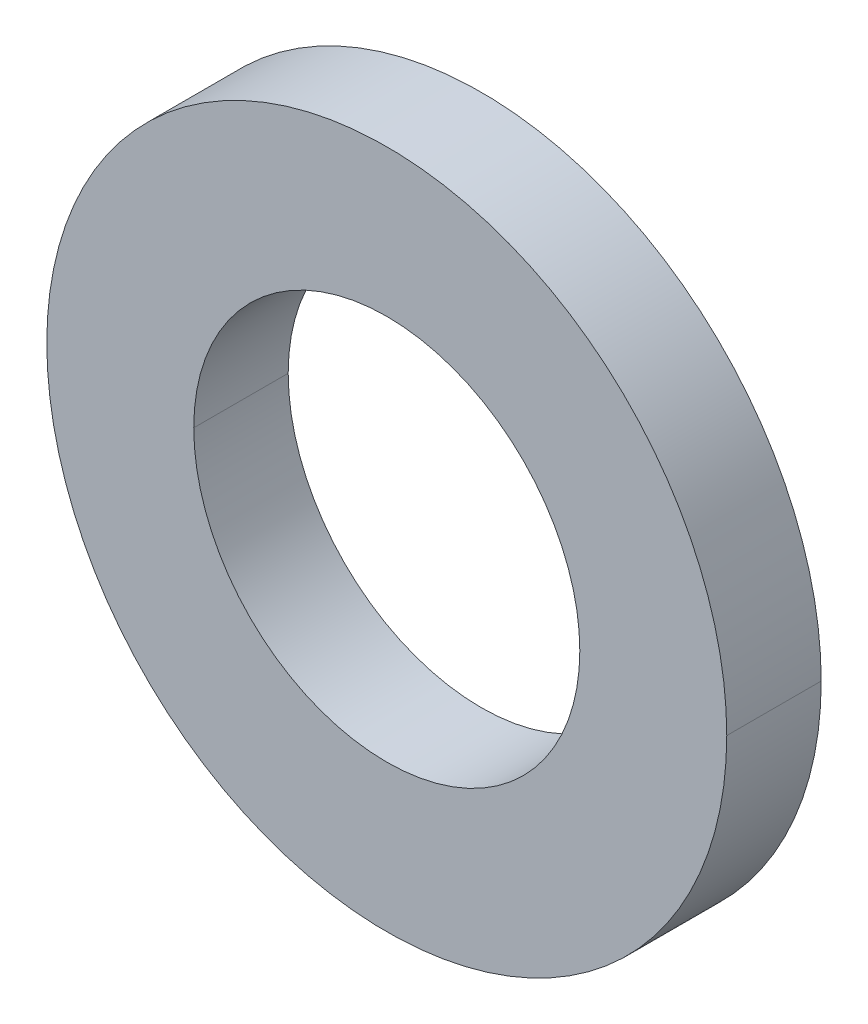
ISO-10303-21;
HEADER;
FILE_DESCRIPTION(('STEP AP214'),'2;1');
FILE_NAME('part.step','',(''),(''),'','','');
FILE_SCHEMA(('AUTOMOTIVE_DESIGN { 1 0 10303 214 1 1 1 1 }'));
ENDSEC;
DATA;
#1=APPLICATION_CONTEXT('core data for automotive mechanical design processes');
#2=APPLICATION_PROTOCOL_DEFINITION('international standard','automotive_design',2000,#1);
#3=PRODUCT_CONTEXT('',#1,'mechanical');
#4=PRODUCT('Part','Part','',(#3));
#5=PRODUCT_RELATED_PRODUCT_CATEGORY('part','',(#4));
#6=PRODUCT_DEFINITION_FORMATION('','',#4);
#7=PRODUCT_DEFINITION_CONTEXT('part definition',#1,'design');
#8=PRODUCT_DEFINITION('design','',#6,#7);
#9=PRODUCT_DEFINITION_SHAPE('','',#8);
#10=(LENGTH_UNIT() NAMED_UNIT(*) SI_UNIT(.MILLI.,.METRE.));
#11=(NAMED_UNIT(*) PLANE_ANGLE_UNIT() SI_UNIT($,.RADIAN.));
#12=(NAMED_UNIT(*) SI_UNIT($,.STERADIAN.) SOLID_ANGLE_UNIT());
#13=UNCERTAINTY_MEASURE_WITH_UNIT(LENGTH_MEASURE(1.E-05),#10,'distance_accuracy_value','');
#14=(GEOMETRIC_REPRESENTATION_CONTEXT(3) GLOBAL_UNCERTAINTY_ASSIGNED_CONTEXT((#13)) GLOBAL_UNIT_ASSIGNED_CONTEXT((#10,
#11,#12)) REPRESENTATION_CONTEXT('',''));
#15=CARTESIAN_POINT('',(0.,0.,0.));
#16=DIRECTION('',(0.,0.,1.));
#17=DIRECTION('',(1.,0.,0.));
#18=AXIS2_PLACEMENT_3D('',#15,#16,#17);
#19=CARTESIAN_POINT('',(0.,0.,-2.5));
#20=DIRECTION('',(0.,0.,1.));
#21=DIRECTION('',(1.,0.,0.));
#22=AXIS2_PLACEMENT_3D('',#19,#20,#21);
#23=PLANE('',#22);
#24=CARTESIAN_POINT('',(0.,0.,-2.5));
#25=DIRECTION('',(0.,0.,1.));
#26=DIRECTION('',(1.,0.,0.));
#27=AXIS2_PLACEMENT_3D('',#24,#25,#26);
#28=CIRCLE('',#27,9.);
#29=CARTESIAN_POINT('',(9.,0.,-2.5));
#30=VERTEX_POINT('',#29);
#31=CARTESIAN_POINT('',(-9.,0.,-2.5));
#32=VERTEX_POINT('',#31);
#33=EDGE_CURVE('E94',#30,#32,#28,.T.);
#34=ORIENTED_EDGE('',*,*,#33,.F.);
#35=CARTESIAN_POINT('',(0.,0.,-2.5));
#36=DIRECTION('',(0.,0.,1.));
#37=DIRECTION('',(1.,0.,0.));
#38=AXIS2_PLACEMENT_3D('',#35,#36,#37);
#39=CIRCLE('',#38,9.);
#40=EDGE_CURVE('E42',#32,#30,#39,.T.);
#41=ORIENTED_EDGE('',*,*,#40,.F.);
#42=EDGE_LOOP('',(#34,#41));
#43=FACE_BOUND('',#42,.T.);
#44=CARTESIAN_POINT('',(0.,0.,-2.5));
#45=DIRECTION('',(0.,0.,1.));
#46=DIRECTION('',(1.,0.,0.));
#47=AXIS2_PLACEMENT_3D('',#44,#45,#46);
#48=CIRCLE('',#47,5.11);
#49=CARTESIAN_POINT('',(5.11,0.,-2.5));
#50=VERTEX_POINT('',#49);
#51=CARTESIAN_POINT('',(-5.11,0.,-2.5));
#52=VERTEX_POINT('',#51);
#53=EDGE_CURVE('E10',#50,#52,#48,.T.);
#54=ORIENTED_EDGE('',*,*,#53,.T.);
#55=CARTESIAN_POINT('',(0.,0.,-2.5));
#56=DIRECTION('',(0.,0.,1.));
#57=DIRECTION('',(1.,0.,0.));
#58=AXIS2_PLACEMENT_3D('',#55,#56,#57);
#59=CIRCLE('',#58,5.11);
#60=EDGE_CURVE('E27',#52,#50,#59,.T.);
#61=ORIENTED_EDGE('',*,*,#60,.T.);
#62=EDGE_LOOP('',(#54,#61));
#63=FACE_BOUND('',#62,.T.);
#64=ADVANCED_FACE('F16',(#43,#63),#23,.F.);
#65=CARTESIAN_POINT('',(0.,0.,-2.5));
#66=DIRECTION('',(0.,0.,1.));
#67=DIRECTION('',(1.,0.,0.));
#68=AXIS2_PLACEMENT_3D('',#65,#66,#67);
#69=CYLINDRICAL_SURFACE('',#68,5.11);
#70=ORIENTED_EDGE('',*,*,#60,.F.);
#71=DIRECTION('',(0.,0.,1.));
#72=VECTOR('',#71,1.);
#73=CARTESIAN_POINT('',(-5.11,0.,-2.5));
#74=LINE('',#73,#72);
#75=CARTESIAN_POINT('',(-5.11,0.,0.));
#76=VERTEX_POINT('',#75);
#77=EDGE_CURVE('E97',#52,#76,#74,.T.);
#78=ORIENTED_EDGE('',*,*,#77,.T.);
#79=CARTESIAN_POINT('',(0.,0.,0.));
#80=DIRECTION('',(0.,0.,1.));
#81=DIRECTION('',(1.,0.,0.));
#82=AXIS2_PLACEMENT_3D('',#79,#80,#81);
#83=CIRCLE('',#82,5.11);
#84=CARTESIAN_POINT('',(5.11,0.,0.));
#85=VERTEX_POINT('',#84);
#86=EDGE_CURVE('E100',#76,#85,#83,.T.);
#87=ORIENTED_EDGE('',*,*,#86,.T.);
#88=DIRECTION('',(0.,0.,1.));
#89=VECTOR('',#88,1.);
#90=CARTESIAN_POINT('',(5.11,0.,-2.5));
#91=LINE('',#90,#89);
#92=EDGE_CURVE('E103',#50,#85,#91,.T.);
#93=ORIENTED_EDGE('',*,*,#92,.F.);
#94=EDGE_LOOP('',(#70,#78,#87,#93));
#95=FACE_BOUND('',#94,.T.);
#96=ADVANCED_FACE('F124',(#95),#69,.F.);
#97=CARTESIAN_POINT('',(0.,0.,-2.5));
#98=DIRECTION('',(0.,0.,1.));
#99=DIRECTION('',(1.,0.,0.));
#100=AXIS2_PLACEMENT_3D('',#97,#98,#99);
#101=CYLINDRICAL_SURFACE('',#100,5.11);
#102=ORIENTED_EDGE('',*,*,#77,.F.);
#103=ORIENTED_EDGE('',*,*,#53,.F.);
#104=ORIENTED_EDGE('',*,*,#92,.T.);
#105=CARTESIAN_POINT('',(0.,0.,0.));
#106=DIRECTION('',(0.,0.,1.));
#107=DIRECTION('',(1.,0.,0.));
#108=AXIS2_PLACEMENT_3D('',#105,#106,#107);
#109=CIRCLE('',#108,5.11);
#110=EDGE_CURVE('E20',#85,#76,#109,.T.);
#111=ORIENTED_EDGE('',*,*,#110,.T.);
#112=EDGE_LOOP('',(#102,#103,#104,#111));
#113=FACE_BOUND('',#112,.T.);
#114=ADVANCED_FACE('F18',(#113),#101,.F.);
#115=CARTESIAN_POINT('',(0.,0.,-2.5));
#116=DIRECTION('',(0.,0.,1.));
#117=DIRECTION('',(1.,0.,0.));
#118=AXIS2_PLACEMENT_3D('',#115,#116,#117);
#119=CYLINDRICAL_SURFACE('',#118,9.);
#120=ORIENTED_EDGE('',*,*,#33,.T.);
#121=DIRECTION('',(0.,0.,1.));
#122=VECTOR('',#121,1.);
#123=CARTESIAN_POINT('',(-9.,0.,-2.5));
#124=LINE('',#123,#122);
#125=CARTESIAN_POINT('',(-9.,0.,0.));
#126=VERTEX_POINT('',#125);
#127=EDGE_CURVE('E72',#32,#126,#124,.T.);
#128=ORIENTED_EDGE('',*,*,#127,.T.);
#129=CARTESIAN_POINT('',(0.,0.,0.));
#130=DIRECTION('',(0.,0.,1.));
#131=DIRECTION('',(1.,0.,0.));
#132=AXIS2_PLACEMENT_3D('',#129,#130,#131);
#133=CIRCLE('',#132,9.);
#134=CARTESIAN_POINT('',(9.,0.,0.));
#135=VERTEX_POINT('',#134);
#136=EDGE_CURVE('E68',#135,#126,#133,.T.);
#137=ORIENTED_EDGE('',*,*,#136,.F.);
#138=DIRECTION('',(0.,0.,1.));
#139=VECTOR('',#138,1.);
#140=CARTESIAN_POINT('',(9.,0.,-2.5));
#141=LINE('',#140,#139);
#142=EDGE_CURVE('E71',#30,#135,#141,.T.);
#143=ORIENTED_EDGE('',*,*,#142,.F.);
#144=EDGE_LOOP('',(#120,#128,#137,#143));
#145=FACE_BOUND('',#144,.T.);
#146=ADVANCED_FACE('F70',(#145),#119,.T.);
#147=CARTESIAN_POINT('',(0.,0.,-2.5));
#148=DIRECTION('',(0.,0.,1.));
#149=DIRECTION('',(1.,0.,0.));
#150=AXIS2_PLACEMENT_3D('',#147,#148,#149);
#151=CYLINDRICAL_SURFACE('',#150,9.);
#152=ORIENTED_EDGE('',*,*,#127,.F.);
#153=ORIENTED_EDGE('',*,*,#40,.T.);
#154=ORIENTED_EDGE('',*,*,#142,.T.);
#155=CARTESIAN_POINT('',(0.,0.,0.));
#156=DIRECTION('',(0.,0.,1.));
#157=DIRECTION('',(1.,0.,0.));
#158=AXIS2_PLACEMENT_3D('',#155,#156,#157);
#159=CIRCLE('',#158,9.);
#160=EDGE_CURVE('E77',#126,#135,#159,.T.);
#161=ORIENTED_EDGE('',*,*,#160,.F.);
#162=EDGE_LOOP('',(#152,#153,#154,#161));
#163=FACE_BOUND('',#162,.T.);
#164=ADVANCED_FACE('F79',(#163),#151,.T.);
#165=CARTESIAN_POINT('',(0.,0.,0.));
#166=DIRECTION('',(0.,0.,1.));
#167=DIRECTION('',(1.,0.,0.));
#168=AXIS2_PLACEMENT_3D('',#165,#166,#167);
#169=PLANE('',#168);
#170=ORIENTED_EDGE('',*,*,#136,.T.);
#171=ORIENTED_EDGE('',*,*,#160,.T.);
#172=EDGE_LOOP('',(#170,#171));
#173=FACE_BOUND('',#172,.T.);
#174=ORIENTED_EDGE('',*,*,#110,.F.);
#175=ORIENTED_EDGE('',*,*,#86,.F.);
#176=EDGE_LOOP('',(#174,#175));
#177=FACE_BOUND('',#176,.T.);
#178=ADVANCED_FACE('F82',(#173,#177),#169,.T.);
#179=CLOSED_SHELL('',(#64,#96,#114,#146,#164,#178));
#180=MANIFOLD_SOLID_BREP('B1',#179);
#181=ADVANCED_BREP_SHAPE_REPRESENTATION('',(#18,#180),#14);
#182=SHAPE_DEFINITION_REPRESENTATION(#9,#181);
ENDSEC;
END-ISO-10303-21;
